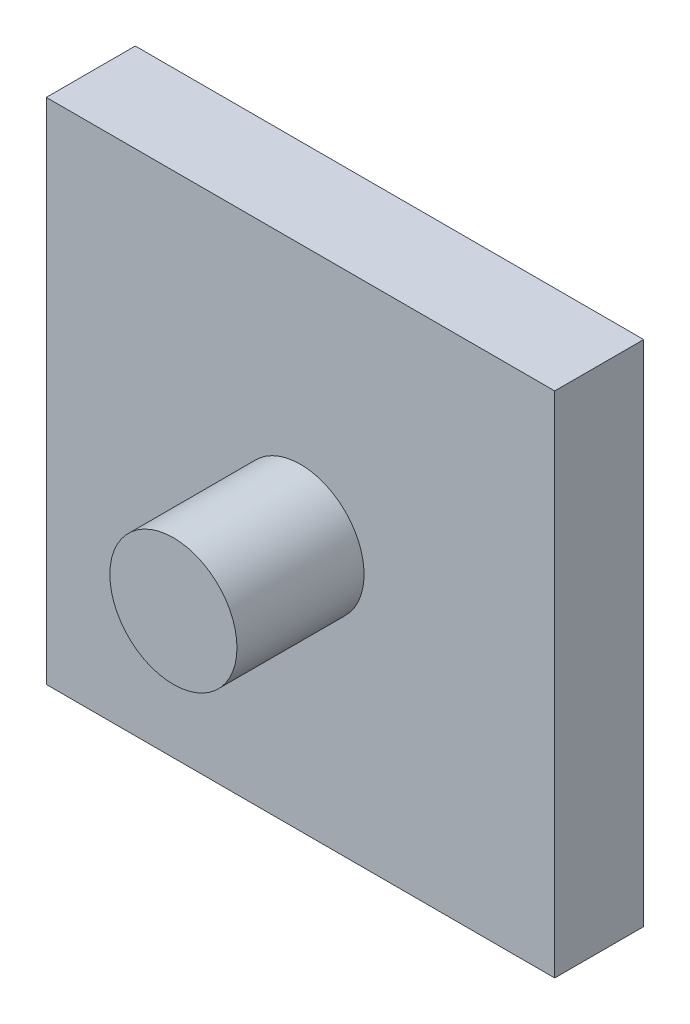
ISO-10303-21;
HEADER;
FILE_DESCRIPTION(('STEP AP214'),'2;1');
FILE_NAME('part.step','',(''),(''),'','','');
FILE_SCHEMA(('AUTOMOTIVE_DESIGN { 1 0 10303 214 1 1 1 1 }'));
ENDSEC;
DATA;
#1=APPLICATION_CONTEXT('core data for automotive mechanical design processes');
#2=APPLICATION_PROTOCOL_DEFINITION('international standard','automotive_design',2000,#1);
#3=PRODUCT_CONTEXT('',#1,'mechanical');
#4=PRODUCT('Part','Part','',(#3));
#5=PRODUCT_RELATED_PRODUCT_CATEGORY('part','',(#4));
#6=PRODUCT_DEFINITION_FORMATION('','',#4);
#7=PRODUCT_DEFINITION_CONTEXT('part definition',#1,'design');
#8=PRODUCT_DEFINITION('design','',#6,#7);
#9=PRODUCT_DEFINITION_SHAPE('','',#8);
#10=(LENGTH_UNIT() NAMED_UNIT(*) SI_UNIT(.MILLI.,.METRE.));
#11=(NAMED_UNIT(*) PLANE_ANGLE_UNIT() SI_UNIT($,.RADIAN.));
#12=(NAMED_UNIT(*) SI_UNIT($,.STERADIAN.) SOLID_ANGLE_UNIT());
#13=UNCERTAINTY_MEASURE_WITH_UNIT(LENGTH_MEASURE(1.E-05),#10,'distance_accuracy_value','');
#14=(GEOMETRIC_REPRESENTATION_CONTEXT(3) GLOBAL_UNCERTAINTY_ASSIGNED_CONTEXT((#13)) GLOBAL_UNIT_ASSIGNED_CONTEXT((#10,
#11,#12)) REPRESENTATION_CONTEXT('',''));
#15=CARTESIAN_POINT('',(0.,0.,0.));
#16=DIRECTION('',(0.,0.,1.));
#17=DIRECTION('',(1.,0.,0.));
#18=AXIS2_PLACEMENT_3D('',#15,#16,#17);
#19=CARTESIAN_POINT('',(-20.,-20.,7.));
#20=DIRECTION('',(1.,0.,0.));
#21=DIRECTION('',(0.,0.,-1.));
#22=AXIS2_PLACEMENT_3D('',#19,#20,#21);
#23=PLANE('',#22);
#24=DIRECTION('',(0.,-1.,0.));
#25=VECTOR('',#24,1.);
#26=CARTESIAN_POINT('',(-20.,-20.,0.));
#27=LINE('',#26,#25);
#28=CARTESIAN_POINT('',(-20.,20.,0.));
#29=VERTEX_POINT('',#28);
#30=CARTESIAN_POINT('',(-20.,-20.,0.));
#31=VERTEX_POINT('',#30);
#32=EDGE_CURVE('E99',#29,#31,#27,.T.);
#33=ORIENTED_EDGE('',*,*,#32,.T.);
#34=DIRECTION('',(0.,0.,-1.));
#35=VECTOR('',#34,1.);
#36=CARTESIAN_POINT('',(-20.,-20.,7.));
#37=LINE('',#36,#35);
#38=CARTESIAN_POINT('',(-20.,-20.,7.));
#39=VERTEX_POINT('',#38);
#40=EDGE_CURVE('E41',#39,#31,#37,.T.);
#41=ORIENTED_EDGE('',*,*,#40,.F.);
#42=DIRECTION('',(0.,-1.,0.));
#43=VECTOR('',#42,1.);
#44=CARTESIAN_POINT('',(-20.,-20.,7.));
#45=LINE('',#44,#43);
#46=CARTESIAN_POINT('',(-20.,20.,7.));
#47=VERTEX_POINT('',#46);
#48=EDGE_CURVE('E85',#47,#39,#45,.T.);
#49=ORIENTED_EDGE('',*,*,#48,.F.);
#50=DIRECTION('',(0.,0.,-1.));
#51=VECTOR('',#50,1.);
#52=CARTESIAN_POINT('',(-20.,20.,7.));
#53=LINE('',#52,#51);
#54=EDGE_CURVE('E95',#47,#29,#53,.T.);
#55=ORIENTED_EDGE('',*,*,#54,.T.);
#56=EDGE_LOOP('',(#33,#41,#49,#55));
#57=FACE_BOUND('',#56,.T.);
#58=ADVANCED_FACE('F33',(#57),#23,.F.);
#59=CARTESIAN_POINT('',(-20.,-20.,7.));
#60=DIRECTION('',(0.,1.,0.));
#61=DIRECTION('',(0.,0.,1.));
#62=AXIS2_PLACEMENT_3D('',#59,#60,#61);
#63=PLANE('',#62);
#64=DIRECTION('',(1.,0.,0.));
#65=VECTOR('',#64,1.);
#66=CARTESIAN_POINT('',(-20.,-20.,0.));
#67=LINE('',#66,#65);
#68=CARTESIAN_POINT('',(20.,-20.,0.));
#69=VERTEX_POINT('',#68);
#70=EDGE_CURVE('E90',#31,#69,#67,.T.);
#71=ORIENTED_EDGE('',*,*,#70,.T.);
#72=DIRECTION('',(0.,0.,-1.));
#73=VECTOR('',#72,1.);
#74=CARTESIAN_POINT('',(20.,-20.,7.));
#75=LINE('',#74,#73);
#76=CARTESIAN_POINT('',(20.,-20.,7.));
#77=VERTEX_POINT('',#76);
#78=EDGE_CURVE('E88',#77,#69,#75,.T.);
#79=ORIENTED_EDGE('',*,*,#78,.F.);
#80=DIRECTION('',(1.,0.,0.));
#81=VECTOR('',#80,1.);
#82=CARTESIAN_POINT('',(-20.,-20.,7.));
#83=LINE('',#82,#81);
#84=EDGE_CURVE('E80',#39,#77,#83,.T.);
#85=ORIENTED_EDGE('',*,*,#84,.F.);
#86=ORIENTED_EDGE('',*,*,#40,.T.);
#87=EDGE_LOOP('',(#71,#79,#85,#86));
#88=FACE_BOUND('',#87,.T.);
#89=ADVANCED_FACE('F89',(#88),#63,.F.);
#90=CARTESIAN_POINT('',(20.,-20.,7.));
#91=DIRECTION('',(-1.,0.,0.));
#92=DIRECTION('',(0.,0.,1.));
#93=AXIS2_PLACEMENT_3D('',#90,#91,#92);
#94=PLANE('',#93);
#95=DIRECTION('',(0.,1.,0.));
#96=VECTOR('',#95,1.);
#97=CARTESIAN_POINT('',(20.,-20.,0.));
#98=LINE('',#97,#96);
#99=CARTESIAN_POINT('',(20.,20.,0.));
#100=VERTEX_POINT('',#99);
#101=EDGE_CURVE('E66',#69,#100,#98,.T.);
#102=ORIENTED_EDGE('',*,*,#101,.T.);
#103=DIRECTION('',(0.,0.,-1.));
#104=VECTOR('',#103,1.);
#105=CARTESIAN_POINT('',(20.,20.,7.));
#106=LINE('',#105,#104);
#107=CARTESIAN_POINT('',(20.,20.,7.));
#108=VERTEX_POINT('',#107);
#109=EDGE_CURVE('E91',#108,#100,#106,.T.);
#110=ORIENTED_EDGE('',*,*,#109,.F.);
#111=DIRECTION('',(0.,1.,0.));
#112=VECTOR('',#111,1.);
#113=CARTESIAN_POINT('',(20.,-20.,7.));
#114=LINE('',#113,#112);
#115=EDGE_CURVE('E83',#77,#108,#114,.T.);
#116=ORIENTED_EDGE('',*,*,#115,.F.);
#117=ORIENTED_EDGE('',*,*,#78,.T.);
#118=EDGE_LOOP('',(#102,#110,#116,#117));
#119=FACE_BOUND('',#118,.T.);
#120=ADVANCED_FACE('F93',(#119),#94,.F.);
#121=CARTESIAN_POINT('',(-20.,20.,7.));
#122=DIRECTION('',(0.,-1.,0.));
#123=DIRECTION('',(0.,0.,-1.));
#124=AXIS2_PLACEMENT_3D('',#121,#122,#123);
#125=PLANE('',#124);
#126=DIRECTION('',(-1.,0.,0.));
#127=VECTOR('',#126,1.);
#128=CARTESIAN_POINT('',(-20.,20.,0.));
#129=LINE('',#128,#127);
#130=EDGE_CURVE('E72',#100,#29,#129,.T.);
#131=ORIENTED_EDGE('',*,*,#130,.T.);
#132=ORIENTED_EDGE('',*,*,#54,.F.);
#133=DIRECTION('',(-1.,0.,0.));
#134=VECTOR('',#133,1.);
#135=CARTESIAN_POINT('',(-20.,20.,7.));
#136=LINE('',#135,#134);
#137=EDGE_CURVE('E49',#108,#47,#136,.T.);
#138=ORIENTED_EDGE('',*,*,#137,.F.);
#139=ORIENTED_EDGE('',*,*,#109,.T.);
#140=EDGE_LOOP('',(#131,#132,#138,#139));
#141=FACE_BOUND('',#140,.T.);
#142=ADVANCED_FACE('F121',(#141),#125,.F.);
#143=CARTESIAN_POINT('',(0.,0.,7.));
#144=DIRECTION('',(0.,0.,-1.));
#145=DIRECTION('',(-1.,0.,0.));
#146=AXIS2_PLACEMENT_3D('',#143,#144,#145);
#147=PLANE('',#146);
#148=CARTESIAN_POINT('',(0.,0.,7.));
#149=DIRECTION('',(0.,0.,-1.));
#150=DIRECTION('',(-1.,0.,0.));
#151=AXIS2_PLACEMENT_3D('',#148,#149,#150);
#152=CIRCLE('',#151,5.);
#153=CARTESIAN_POINT('',(-5.,0.,7.));
#154=VERTEX_POINT('',#153);
#155=EDGE_CURVE('E11',#154,#154,#152,.F.);
#156=ORIENTED_EDGE('',*,*,#155,.F.);
#157=EDGE_LOOP('',(#156));
#158=FACE_BOUND('',#157,.T.);
#159=ORIENTED_EDGE('',*,*,#48,.T.);
#160=ORIENTED_EDGE('',*,*,#84,.T.);
#161=ORIENTED_EDGE('',*,*,#115,.T.);
#162=ORIENTED_EDGE('',*,*,#137,.T.);
#163=EDGE_LOOP('',(#159,#160,#161,#162));
#164=FACE_BOUND('',#163,.T.);
#165=ADVANCED_FACE('F81',(#158,#164),#147,.F.);
#166=CARTESIAN_POINT('',(0.,0.,0.));
#167=DIRECTION('',(0.,0.,-1.));
#168=DIRECTION('',(-1.,0.,0.));
#169=AXIS2_PLACEMENT_3D('',#166,#167,#168);
#170=PLANE('',#169);
#171=ORIENTED_EDGE('',*,*,#32,.F.);
#172=ORIENTED_EDGE('',*,*,#130,.F.);
#173=ORIENTED_EDGE('',*,*,#101,.F.);
#174=ORIENTED_EDGE('',*,*,#70,.F.);
#175=EDGE_LOOP('',(#171,#172,#173,#174));
#176=FACE_BOUND('',#175,.T.);
#177=ADVANCED_FACE('F110',(#176),#170,.T.);
#178=CARTESIAN_POINT('',(0.,0.,17.));
#179=DIRECTION('',(0.,0.,-1.));
#180=DIRECTION('',(-1.,0.,0.));
#181=AXIS2_PLACEMENT_3D('',#178,#179,#180);
#182=CYLINDRICAL_SURFACE('',#181,5.);
#183=CARTESIAN_POINT('',(0.,0.,17.));
#184=DIRECTION('',(0.,0.,1.));
#185=DIRECTION('',(1.,0.,0.));
#186=AXIS2_PLACEMENT_3D('',#183,#184,#185);
#187=CIRCLE('',#186,5.);
#188=CARTESIAN_POINT('',(5.,0.,17.));
#189=VERTEX_POINT('',#188);
#190=EDGE_CURVE('E102',#189,#189,#187,.T.);
#191=ORIENTED_EDGE('',*,*,#190,.F.);
#192=EDGE_LOOP('',(#191));
#193=FACE_BOUND('',#192,.T.);
#194=ORIENTED_EDGE('',*,*,#155,.T.);
#195=EDGE_LOOP('',(#194));
#196=FACE_BOUND('',#195,.T.);
#197=ADVANCED_FACE('F112',(#193,#196),#182,.T.);
#198=CARTESIAN_POINT('',(0.,0.,17.));
#199=DIRECTION('',(0.,0.,1.));
#200=DIRECTION('',(1.,0.,0.));
#201=AXIS2_PLACEMENT_3D('',#198,#199,#200);
#202=PLANE('',#201);
#203=ORIENTED_EDGE('',*,*,#190,.T.);
#204=EDGE_LOOP('',(#203));
#205=FACE_BOUND('',#204,.T.);
#206=ADVANCED_FACE('F118',(#205),#202,.T.);
#207=CLOSED_SHELL('',(#58,#89,#120,#142,#165,#177,#197,#206));
#208=MANIFOLD_SOLID_BREP('B2',#207);
#209=ADVANCED_BREP_SHAPE_REPRESENTATION('',(#18,#208),#14);
#210=SHAPE_DEFINITION_REPRESENTATION(#9,#209);
ENDSEC;
END-ISO-10303-21;
